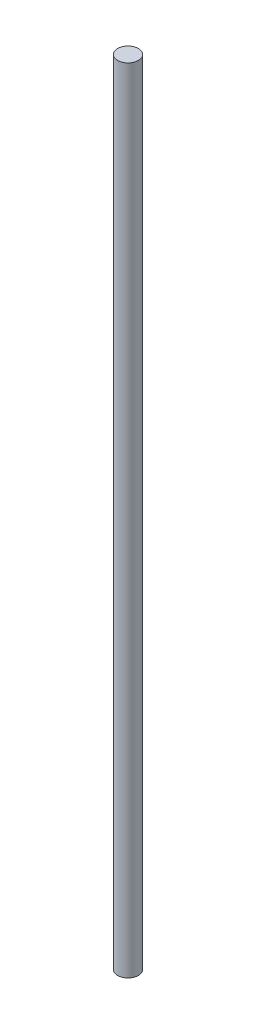
ISO-10303-21;
HEADER;
FILE_DESCRIPTION(('STEP AP214'),'2;1');
FILE_NAME('part.step','',(''),(''),'','','');
FILE_SCHEMA(('AUTOMOTIVE_DESIGN { 1 0 10303 214 1 1 1 1 }'));
ENDSEC;
DATA;
#1=APPLICATION_CONTEXT('core data for automotive mechanical design processes');
#2=APPLICATION_PROTOCOL_DEFINITION('international standard','automotive_design',2000,#1);
#3=PRODUCT_CONTEXT('',#1,'mechanical');
#4=PRODUCT('Part','Part','',(#3));
#5=PRODUCT_RELATED_PRODUCT_CATEGORY('part','',(#4));
#6=PRODUCT_DEFINITION_FORMATION('','',#4);
#7=PRODUCT_DEFINITION_CONTEXT('part definition',#1,'design');
#8=PRODUCT_DEFINITION('design','',#6,#7);
#9=PRODUCT_DEFINITION_SHAPE('','',#8);
#10=(LENGTH_UNIT() NAMED_UNIT(*) SI_UNIT(.MILLI.,.METRE.));
#11=(NAMED_UNIT(*) PLANE_ANGLE_UNIT() SI_UNIT($,.RADIAN.));
#12=(NAMED_UNIT(*) SI_UNIT($,.STERADIAN.) SOLID_ANGLE_UNIT());
#13=UNCERTAINTY_MEASURE_WITH_UNIT(LENGTH_MEASURE(1.E-05),#10,'distance_accuracy_value','');
#14=(GEOMETRIC_REPRESENTATION_CONTEXT(3) GLOBAL_UNCERTAINTY_ASSIGNED_CONTEXT((#13)) GLOBAL_UNIT_ASSIGNED_CONTEXT((#10,
#11,#12)) REPRESENTATION_CONTEXT('',''));
#15=CARTESIAN_POINT('',(0.,0.,0.));
#16=DIRECTION('',(0.,0.,1.));
#17=DIRECTION('',(1.,0.,0.));
#18=AXIS2_PLACEMENT_3D('',#15,#16,#17);
#19=CARTESIAN_POINT('',(0.,305.999999999999,0.));
#20=DIRECTION('',(0.,-1.,0.));
#21=DIRECTION('',(0.,0.,-1.));
#22=AXIS2_PLACEMENT_3D('',#19,#20,#21);
#23=CYLINDRICAL_SURFACE('',#22,4.);
#24=CARTESIAN_POINT('',(0.,305.999999999999,0.));
#25=DIRECTION('',(0.,1.,0.));
#26=DIRECTION('',(0.,0.,1.));
#27=AXIS2_PLACEMENT_3D('',#24,#25,#26);
#28=CIRCLE('',#27,4.);
#29=CARTESIAN_POINT('',(0.,305.999999999999,4.));
#30=VERTEX_POINT('',#29);
#31=EDGE_CURVE('E10',#30,#30,#28,.T.);
#32=ORIENTED_EDGE('',*,*,#31,.F.);
#33=EDGE_LOOP('',(#32));
#34=FACE_BOUND('',#33,.T.);
#35=CARTESIAN_POINT('',(0.,0.,0.));
#36=DIRECTION('',(0.,1.,0.));
#37=DIRECTION('',(0.,0.,1.));
#38=AXIS2_PLACEMENT_3D('',#35,#36,#37);
#39=CIRCLE('',#38,4.);
#40=CARTESIAN_POINT('',(0.,0.,4.));
#41=VERTEX_POINT('',#40);
#42=EDGE_CURVE('E34',#41,#41,#39,.T.);
#43=ORIENTED_EDGE('',*,*,#42,.T.);
#44=EDGE_LOOP('',(#43));
#45=FACE_BOUND('',#44,.T.);
#46=ADVANCED_FACE('F31',(#34,#45),#23,.T.);
#47=CARTESIAN_POINT('',(0.,305.999999999999,0.));
#48=DIRECTION('',(0.,1.,0.));
#49=DIRECTION('',(0.,0.,1.));
#50=AXIS2_PLACEMENT_3D('',#47,#48,#49);
#51=PLANE('',#50);
#52=ORIENTED_EDGE('',*,*,#31,.T.);
#53=EDGE_LOOP('',(#52));
#54=FACE_BOUND('',#53,.T.);
#55=ADVANCED_FACE('F46',(#54),#51,.T.);
#56=CARTESIAN_POINT('',(0.,0.,0.));
#57=DIRECTION('',(0.,1.,0.));
#58=DIRECTION('',(0.,0.,1.));
#59=AXIS2_PLACEMENT_3D('',#56,#57,#58);
#60=PLANE('',#59);
#61=ORIENTED_EDGE('',*,*,#42,.F.);
#62=EDGE_LOOP('',(#61));
#63=FACE_BOUND('',#62,.T.);
#64=ADVANCED_FACE('F44',(#63),#60,.F.);
#65=CLOSED_SHELL('',(#46,#55,#64));
#66=MANIFOLD_SOLID_BREP('B2',#65);
#67=ADVANCED_BREP_SHAPE_REPRESENTATION('',(#18,#66),#14);
#68=SHAPE_DEFINITION_REPRESENTATION(#9,#67);
ENDSEC;
END-ISO-10303-21;
